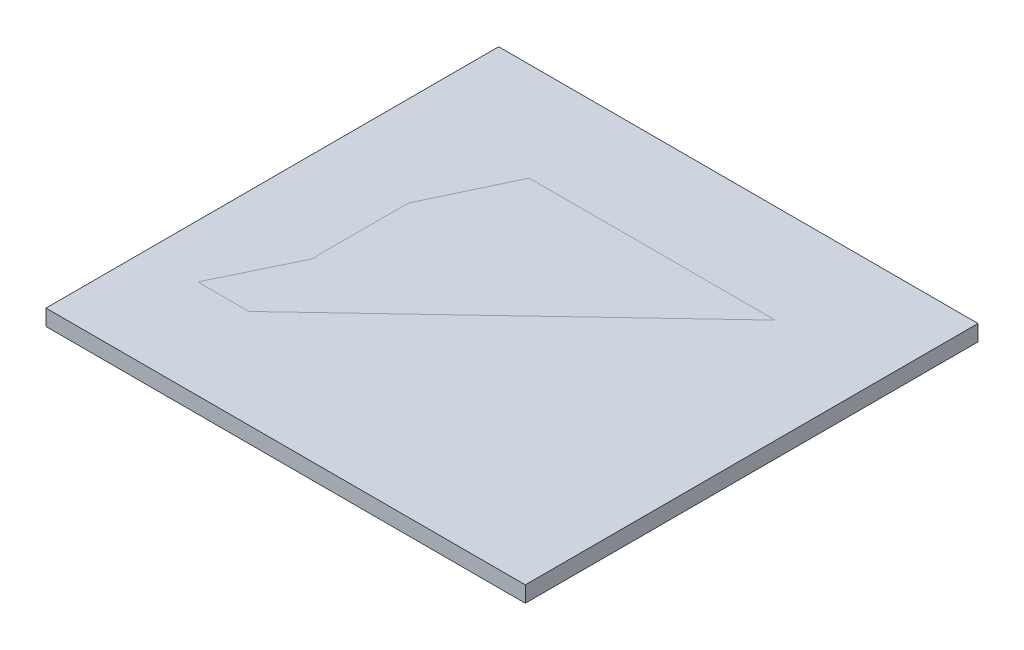
ISO-10303-21;
HEADER;
FILE_DESCRIPTION(('STEP AP214'),'2;1');
FILE_NAME('part.step','',(''),(''),'','','');
FILE_SCHEMA(('AUTOMOTIVE_DESIGN { 1 0 10303 214 1 1 1 1 }'));
ENDSEC;
DATA;
#1=APPLICATION_CONTEXT('core data for automotive mechanical design processes');
#2=APPLICATION_PROTOCOL_DEFINITION('international standard','automotive_design',2000,#1);
#3=PRODUCT_CONTEXT('',#1,'mechanical');
#4=PRODUCT('Part','Part','',(#3));
#5=PRODUCT_RELATED_PRODUCT_CATEGORY('part','',(#4));
#6=PRODUCT_DEFINITION_FORMATION('','',#4);
#7=PRODUCT_DEFINITION_CONTEXT('part definition',#1,'design');
#8=PRODUCT_DEFINITION('design','',#6,#7);
#9=PRODUCT_DEFINITION_SHAPE('','',#8);
#10=(LENGTH_UNIT() NAMED_UNIT(*) SI_UNIT(.MILLI.,.METRE.));
#11=(NAMED_UNIT(*) PLANE_ANGLE_UNIT() SI_UNIT($,.RADIAN.));
#12=(NAMED_UNIT(*) SI_UNIT($,.STERADIAN.) SOLID_ANGLE_UNIT());
#13=UNCERTAINTY_MEASURE_WITH_UNIT(LENGTH_MEASURE(1.E-05),#10,'distance_accuracy_value','');
#14=(GEOMETRIC_REPRESENTATION_CONTEXT(3) GLOBAL_UNCERTAINTY_ASSIGNED_CONTEXT((#13)) GLOBAL_UNIT_ASSIGNED_CONTEXT((#10,
#11,#12)) REPRESENTATION_CONTEXT('',''));
#15=CARTESIAN_POINT('',(0.,0.,0.));
#16=DIRECTION('',(0.,0.,1.));
#17=DIRECTION('',(1.,0.,0.));
#18=AXIS2_PLACEMENT_3D('',#15,#16,#17);
#19=CARTESIAN_POINT('',(-19.0585691573927,3.,0.));
#20=DIRECTION('',(-1.,0.,0.));
#21=DIRECTION('',(0.,0.,1.));
#22=AXIS2_PLACEMENT_3D('',#19,#20,#21);
#23=PLANE('',#22);
#24=DIRECTION('',(0.,0.,-1.));
#25=VECTOR('',#24,1.);
#26=CARTESIAN_POINT('',(-19.0585691573927,3.,0.));
#27=LINE('',#26,#25);
#28=CARTESIAN_POINT('',(-19.0585691573927,3.,-3.12464517993928));
#29=VERTEX_POINT('',#28);
#30=CARTESIAN_POINT('',(-19.0585691573927,3.,-11.1246451799393));
#31=VERTEX_POINT('',#30);
#32=EDGE_CURVE('E154',#29,#31,#27,.T.);
#33=ORIENTED_EDGE('',*,*,#32,.T.);
#34=DIRECTION('',(0.,1.,0.));
#35=VECTOR('',#34,1.);
#36=CARTESIAN_POINT('',(-19.0585691573927,-7.,-11.1246451799393));
#37=LINE('',#36,#35);
#38=CARTESIAN_POINT('',(-19.0585691573927,0.,-11.1246451799393));
#39=VERTEX_POINT('',#38);
#40=EDGE_CURVE('E148',#39,#31,#37,.T.);
#41=ORIENTED_EDGE('',*,*,#40,.F.);
#42=DIRECTION('',(0.,0.,-1.));
#43=VECTOR('',#42,1.);
#44=CARTESIAN_POINT('',(-19.0585691573927,0.,0.));
#45=LINE('',#44,#43);
#46=CARTESIAN_POINT('',(-19.0585691573927,0.,-3.12464517993928));
#47=VERTEX_POINT('',#46);
#48=EDGE_CURVE('E220',#47,#39,#45,.T.);
#49=ORIENTED_EDGE('',*,*,#48,.F.);
#50=DIRECTION('',(0.,-1.,0.));
#51=VECTOR('',#50,1.);
#52=CARTESIAN_POINT('',(-19.0585691573927,3.,-3.12464517993928));
#53=LINE('',#52,#51);
#54=EDGE_CURVE('E74',#29,#47,#53,.T.);
#55=ORIENTED_EDGE('',*,*,#54,.F.);
#56=EDGE_LOOP('',(#33,#41,#49,#55));
#57=FACE_BOUND('',#56,.T.);
#58=ADVANCED_FACE('F51',(#57),#23,.T.);
#59=CARTESIAN_POINT('',(0.,3.,0.));
#60=DIRECTION('',(0.,1.,0.));
#61=DIRECTION('',(0.,0.,1.));
#62=AXIS2_PLACEMENT_3D('',#59,#60,#61);
#63=PLANE('',#62);
#64=CARTESIAN_POINT('',(50.9414308426073,3.,2.82535482006072));
#65=DIRECTION('',(0.,1.,0.));
#66=DIRECTION('',(0.,0.,1.));
#67=AXIS2_PLACEMENT_3D('',#64,#65,#66);
#68=CIRCLE('',#67,2.);
#69=CARTESIAN_POINT('',(50.9414308426073,3.,4.82535482006073));
#70=VERTEX_POINT('',#69);
#71=EDGE_CURVE('E231',#70,#70,#68,.T.);
#72=ORIENTED_EDGE('',*,*,#71,.F.);
#73=EDGE_LOOP('',(#72));
#74=FACE_BOUND('',#73,.T.);
#75=CARTESIAN_POINT('',(50.9414308426073,3.,19.9253548200607));
#76=DIRECTION('',(0.,1.,0.));
#77=DIRECTION('',(0.,0.,1.));
#78=AXIS2_PLACEMENT_3D('',#75,#76,#77);
#79=CIRCLE('',#78,2.);
#80=CARTESIAN_POINT('',(50.9414308426073,3.,21.9253548200607));
#81=VERTEX_POINT('',#80);
#82=EDGE_CURVE('E228',#81,#81,#79,.T.);
#83=ORIENTED_EDGE('',*,*,#82,.F.);
#84=EDGE_LOOP('',(#83));
#85=FACE_BOUND('',#84,.T.);
#86=CARTESIAN_POINT('',(-14.0585691573927,3.,21.9253548200607));
#87=DIRECTION('',(0.,1.,0.));
#88=DIRECTION('',(0.,0.,1.));
#89=AXIS2_PLACEMENT_3D('',#86,#87,#88);
#90=CIRCLE('',#89,2.);
#91=CARTESIAN_POINT('',(-14.0585691573927,3.,23.9253548200607));
#92=VERTEX_POINT('',#91);
#93=EDGE_CURVE('E225',#92,#92,#90,.T.);
#94=ORIENTED_EDGE('',*,*,#93,.F.);
#95=EDGE_LOOP('',(#94));
#96=FACE_BOUND('',#95,.T.);
#97=CARTESIAN_POINT('',(-14.0585691573927,3.,3.82535482006073));
#98=DIRECTION('',(0.,1.,0.));
#99=DIRECTION('',(0.,0.,1.));
#100=AXIS2_PLACEMENT_3D('',#97,#98,#99);
#101=CIRCLE('',#100,2.);
#102=CARTESIAN_POINT('',(-14.0585691573927,3.,5.82535482006073));
#103=VERTEX_POINT('',#102);
#104=EDGE_CURVE('E222',#103,#103,#101,.T.);
#105=ORIENTED_EDGE('',*,*,#104,.F.);
#106=EDGE_LOOP('',(#105));
#107=FACE_BOUND('',#106,.T.);
#108=CARTESIAN_POINT('',(-19.0585691573927,3.,28.8753548200607));
#109=CARTESIAN_POINT('',(-19.0585691573927,3.,18.208688153394));
#110=CARTESIAN_POINT('',(-19.0585691573927,3.,7.54202148672738));
#111=CARTESIAN_POINT('',(-19.0585691573927,3.,-3.12464517993928));
#112=CARTESIAN_POINT('',(-19.0585691573927,3.,-4.54756167714658));
#113=CARTESIAN_POINT('',(-19.0585691573927,3.,-7.39339467156118));
#114=CARTESIAN_POINT('',(-13.3273186490146,3.,-11.1246451799393));
#115=CARTESIAN_POINT('',(-10.4814856546,3.,-11.1246451799393));
#116=CARTESIAN_POINT('',(-9.05856915739271,3.,-11.1246451799393));
#117=CARTESIAN_POINT('',(9.27476417594063,3.,-11.1246451799393));
#118=CARTESIAN_POINT('',(27.608097509274,3.,-11.1246451799393));
#119=CARTESIAN_POINT('',(45.9414308426073,3.,-11.1246451799393));
#120=B_SPLINE_CURVE_WITH_KNOTS('',3,(#108,#109,#110,#111,#112,#113,#114,#115,#116,#117,#118,
#119),.UNSPECIFIED.,.F.,.F.,(4,3,1,1,3,4),(0.,0.320621208481337,0.363391571628459,
0.406161934775581,0.448932297922703,1.),.UNSPECIFIED.);
#121=CARTESIAN_POINT('',(-4.83882903794871,3.,-11.1246451799393));
#122=VERTEX_POINT('',#121);
#123=CARTESIAN_POINT('',(45.9414308426073,3.,-11.1246451799393));
#124=VERTEX_POINT('',#123);
#125=EDGE_CURVE('E136',#122,#124,#120,.T.);
#126=ORIENTED_EDGE('',*,*,#125,.F.);
#127=DIRECTION('',(-1.,0.,0.));
#128=VECTOR('',#127,1.);
#129=CARTESIAN_POINT('',(-19.0585691573927,3.,-11.1246451799393));
#130=LINE('',#129,#128);
#131=EDGE_CURVE('E189',#122,#31,#130,.T.);
#132=ORIENTED_EDGE('',*,*,#131,.T.);
#133=ORIENTED_EDGE('',*,*,#32,.F.);
#134=CARTESIAN_POINT('',(-19.0585691573927,3.,28.8753548200607));
#135=VERTEX_POINT('',#134);
#136=EDGE_CURVE('E143',#135,#29,#120,.T.);
#137=ORIENTED_EDGE('',*,*,#136,.F.);
#138=DIRECTION('',(0.,0.,1.));
#139=VECTOR('',#138,1.);
#140=CARTESIAN_POINT('',(-19.0585691573927,3.,-11.1246451799393));
#141=LINE('',#140,#139);
#142=CARTESIAN_POINT('',(-19.0585691573927,3.,36.8753548200607));
#143=VERTEX_POINT('',#142);
#144=EDGE_CURVE('E95',#135,#143,#141,.T.);
#145=ORIENTED_EDGE('',*,*,#144,.T.);
#146=DIRECTION('',(1.,0.,0.));
#147=VECTOR('',#146,1.);
#148=CARTESIAN_POINT('',(0.,3.,36.8753548200607));
#149=LINE('',#148,#147);
#150=CARTESIAN_POINT('',(55.9414308426073,3.,36.8753548200607));
#151=VERTEX_POINT('',#150);
#152=EDGE_CURVE('E137',#143,#151,#149,.T.);
#153=ORIENTED_EDGE('',*,*,#152,.T.);
#154=DIRECTION('',(0.,0.,1.));
#155=VECTOR('',#154,1.);
#156=CARTESIAN_POINT('',(55.9414308426073,3.,0.));
#157=LINE('',#156,#155);
#158=CARTESIAN_POINT('',(55.9414308426073,3.,-11.1246451799393));
#159=VERTEX_POINT('',#158);
#160=EDGE_CURVE('E126',#159,#151,#157,.T.);
#161=ORIENTED_EDGE('',*,*,#160,.F.);
#162=EDGE_CURVE('E150',#159,#124,#130,.T.);
#163=ORIENTED_EDGE('',*,*,#162,.T.);
#164=EDGE_LOOP('',(#126,#132,#133,#137,#145,#153,#161,#163));
#165=FACE_BOUND('',#164,.T.);
#166=ADVANCED_FACE('F140',(#74,#85,#96,#107,#165),#63,.T.);
#167=CARTESIAN_POINT('',(0.,0.,0.));
#168=DIRECTION('',(0.,1.,0.));
#169=DIRECTION('',(0.,0.,1.));
#170=AXIS2_PLACEMENT_3D('',#167,#168,#169);
#171=PLANE('',#170);
#172=CARTESIAN_POINT('',(50.9414308426073,0.,2.82535482006072));
#173=DIRECTION('',(0.,1.,0.));
#174=DIRECTION('',(0.,0.,1.));
#175=AXIS2_PLACEMENT_3D('',#172,#173,#174);
#176=CIRCLE('',#175,2.);
#177=CARTESIAN_POINT('',(50.9414308426073,0.,4.82535482006073));
#178=VERTEX_POINT('',#177);
#179=EDGE_CURVE('E209',#178,#178,#176,.T.);
#180=ORIENTED_EDGE('',*,*,#179,.T.);
#181=EDGE_LOOP('',(#180));
#182=FACE_BOUND('',#181,.T.);
#183=CARTESIAN_POINT('',(50.9414308426073,0.,19.9253548200607));
#184=DIRECTION('',(0.,1.,0.));
#185=DIRECTION('',(0.,0.,1.));
#186=AXIS2_PLACEMENT_3D('',#183,#184,#185);
#187=CIRCLE('',#186,2.);
#188=CARTESIAN_POINT('',(50.9414308426073,0.,21.9253548200607));
#189=VERTEX_POINT('',#188);
#190=EDGE_CURVE('E213',#189,#189,#187,.T.);
#191=ORIENTED_EDGE('',*,*,#190,.T.);
#192=EDGE_LOOP('',(#191));
#193=FACE_BOUND('',#192,.T.);
#194=CARTESIAN_POINT('',(-14.0585691573927,0.,21.9253548200607));
#195=DIRECTION('',(0.,1.,0.));
#196=DIRECTION('',(0.,0.,1.));
#197=AXIS2_PLACEMENT_3D('',#194,#195,#196);
#198=CIRCLE('',#197,2.);
#199=CARTESIAN_POINT('',(-14.0585691573927,0.,23.9253548200607));
#200=VERTEX_POINT('',#199);
#201=EDGE_CURVE('E250',#200,#200,#198,.T.);
#202=ORIENTED_EDGE('',*,*,#201,.T.);
#203=EDGE_LOOP('',(#202));
#204=FACE_BOUND('',#203,.T.);
#205=CARTESIAN_POINT('',(-14.0585691573927,0.,3.82535482006073));
#206=DIRECTION('',(0.,1.,0.));
#207=DIRECTION('',(0.,0.,1.));
#208=AXIS2_PLACEMENT_3D('',#205,#206,#207);
#209=CIRCLE('',#208,2.);
#210=CARTESIAN_POINT('',(-14.0585691573927,0.,5.82535482006073));
#211=VERTEX_POINT('',#210);
#212=EDGE_CURVE('E156',#211,#211,#209,.T.);
#213=ORIENTED_EDGE('',*,*,#212,.T.);
#214=EDGE_LOOP('',(#213));
#215=FACE_BOUND('',#214,.T.);
#216=DIRECTION('',(-1.,0.,0.));
#217=VECTOR('',#216,1.);
#218=CARTESIAN_POINT('',(0.,0.,-11.1246451799393));
#219=LINE('',#218,#217);
#220=CARTESIAN_POINT('',(-4.83882903794871,0.,-11.1246451799393));
#221=VERTEX_POINT('',#220);
#222=EDGE_CURVE('E12',#221,#39,#219,.T.);
#223=ORIENTED_EDGE('',*,*,#222,.F.);
#224=CARTESIAN_POINT('',(-19.0585691573927,0.,28.8753548200607));
#225=CARTESIAN_POINT('',(-19.0585691573927,0.,18.208688153394));
#226=CARTESIAN_POINT('',(-19.0585691573927,0.,7.54202148672738));
#227=CARTESIAN_POINT('',(-19.0585691573927,0.,-3.12464517993928));
#228=CARTESIAN_POINT('',(-19.0585691573927,0.,-4.54756167714658));
#229=CARTESIAN_POINT('',(-19.0585691573927,0.,-7.39339467156118));
#230=CARTESIAN_POINT('',(-13.3273186490146,0.,-11.1246451799393));
#231=CARTESIAN_POINT('',(-10.4814856546,0.,-11.1246451799393));
#232=CARTESIAN_POINT('',(-9.05856915739271,0.,-11.1246451799393));
#233=CARTESIAN_POINT('',(9.27476417594063,0.,-11.1246451799393));
#234=CARTESIAN_POINT('',(27.608097509274,0.,-11.1246451799393));
#235=CARTESIAN_POINT('',(45.9414308426073,0.,-11.1246451799393));
#236=B_SPLINE_CURVE_WITH_KNOTS('',3,(#224,#225,#226,#227,#228,#229,#230,#231,#232,#233,#234,
#235),.UNSPECIFIED.,.F.,.F.,(4,3,1,1,3,4),(0.,0.320621208481337,0.363391571628459,
0.406161934775581,0.448932297922703,1.),.UNSPECIFIED.);
#237=CARTESIAN_POINT('',(45.9414308426073,0.,-11.1246451799393));
#238=VERTEX_POINT('',#237);
#239=EDGE_CURVE('E207',#221,#238,#236,.T.);
#240=ORIENTED_EDGE('',*,*,#239,.T.);
#241=CARTESIAN_POINT('',(55.9414308426073,0.,-11.1246451799393));
#242=VERTEX_POINT('',#241);
#243=EDGE_CURVE('E54',#242,#238,#219,.T.);
#244=ORIENTED_EDGE('',*,*,#243,.F.);
#245=DIRECTION('',(0.,0.,1.));
#246=VECTOR('',#245,1.);
#247=CARTESIAN_POINT('',(55.9414308426073,0.,0.));
#248=LINE('',#247,#246);
#249=CARTESIAN_POINT('',(55.9414308426073,0.,36.8753548200607));
#250=VERTEX_POINT('',#249);
#251=EDGE_CURVE('E210',#242,#250,#248,.T.);
#252=ORIENTED_EDGE('',*,*,#251,.T.);
#253=DIRECTION('',(1.,0.,0.));
#254=VECTOR('',#253,1.);
#255=CARTESIAN_POINT('',(0.,0.,36.8753548200607));
#256=LINE('',#255,#254);
#257=CARTESIAN_POINT('',(-19.0585691573927,0.,36.8753548200607));
#258=VERTEX_POINT('',#257);
#259=EDGE_CURVE('E65',#258,#250,#256,.T.);
#260=ORIENTED_EDGE('',*,*,#259,.F.);
#261=DIRECTION('',(0.,0.,1.));
#262=VECTOR('',#261,1.);
#263=CARTESIAN_POINT('',(-19.0585691573927,0.,0.));
#264=LINE('',#263,#262);
#265=CARTESIAN_POINT('',(-19.0585691573927,0.,28.8753548200607));
#266=VERTEX_POINT('',#265);
#267=EDGE_CURVE('E194',#266,#258,#264,.T.);
#268=ORIENTED_EDGE('',*,*,#267,.F.);
#269=EDGE_CURVE('E191',#266,#47,#236,.T.);
#270=ORIENTED_EDGE('',*,*,#269,.T.);
#271=ORIENTED_EDGE('',*,*,#48,.T.);
#272=EDGE_LOOP('',(#223,#240,#244,#252,#260,#268,#270,#271));
#273=FACE_BOUND('',#272,.T.);
#274=ADVANCED_FACE('F179',(#182,#193,#204,#215,#273),#171,.F.);
#275=DIRECTION('',(0.,-1.,0.));
#276=VECTOR('',#275,1.);
#277=SURFACE_OF_LINEAR_EXTRUSION('',#120,#276);
#278=ORIENTED_EDGE('',*,*,#269,.F.);
#279=DIRECTION('',(0.,-1.,0.));
#280=VECTOR('',#279,1.);
#281=CARTESIAN_POINT('',(-19.0585691573927,3.,28.8753548200607));
#282=LINE('',#281,#280);
#283=EDGE_CURVE('E91',#135,#266,#282,.T.);
#284=ORIENTED_EDGE('',*,*,#283,.F.);
#285=ORIENTED_EDGE('',*,*,#136,.T.);
#286=ORIENTED_EDGE('',*,*,#54,.T.);
#287=EDGE_LOOP('',(#278,#284,#285,#286));
#288=FACE_BOUND('',#287,.T.);
#289=ADVANCED_FACE('F171',(#288),#277,.T.);
#290=CARTESIAN_POINT('',(0.,3.,36.8753548200607));
#291=DIRECTION('',(0.,0.,-1.));
#292=DIRECTION('',(-1.,0.,0.));
#293=AXIS2_PLACEMENT_3D('',#290,#291,#292);
#294=PLANE('',#293);
#295=ORIENTED_EDGE('',*,*,#259,.T.);
#296=DIRECTION('',(0.,1.,0.));
#297=VECTOR('',#296,1.);
#298=CARTESIAN_POINT('',(55.9414308426073,-7.,36.8753548200607));
#299=LINE('',#298,#297);
#300=EDGE_CURVE('E130',#250,#151,#299,.T.);
#301=ORIENTED_EDGE('',*,*,#300,.T.);
#302=ORIENTED_EDGE('',*,*,#152,.F.);
#303=DIRECTION('',(0.,1.,0.));
#304=VECTOR('',#303,1.);
#305=CARTESIAN_POINT('',(-19.0585691573927,-7.,36.8753548200607));
#306=LINE('',#305,#304);
#307=EDGE_CURVE('E146',#258,#143,#306,.T.);
#308=ORIENTED_EDGE('',*,*,#307,.F.);
#309=EDGE_LOOP('',(#295,#301,#302,#308));
#310=FACE_BOUND('',#309,.T.);
#311=ADVANCED_FACE('F145',(#310),#294,.F.);
#312=CARTESIAN_POINT('',(55.9414308426073,3.,0.));
#313=DIRECTION('',(1.,0.,0.));
#314=DIRECTION('',(0.,0.,-1.));
#315=AXIS2_PLACEMENT_3D('',#312,#313,#314);
#316=PLANE('',#315);
#317=ORIENTED_EDGE('',*,*,#251,.F.);
#318=DIRECTION('',(0.,1.,0.));
#319=VECTOR('',#318,1.);
#320=CARTESIAN_POINT('',(55.9414308426073,-7.,-11.1246451799393));
#321=LINE('',#320,#319);
#322=EDGE_CURVE('E132',#242,#159,#321,.T.);
#323=ORIENTED_EDGE('',*,*,#322,.T.);
#324=ORIENTED_EDGE('',*,*,#160,.T.);
#325=ORIENTED_EDGE('',*,*,#300,.F.);
#326=EDGE_LOOP('',(#317,#323,#324,#325));
#327=FACE_BOUND('',#326,.T.);
#328=ADVANCED_FACE('F128',(#327),#316,.T.);
#329=CARTESIAN_POINT('',(-14.0585691573927,3.,3.82535482006073));
#330=DIRECTION('',(0.,-1.,0.));
#331=DIRECTION('',(0.,0.,-1.));
#332=AXIS2_PLACEMENT_3D('',#329,#330,#331);
#333=CYLINDRICAL_SURFACE('',#332,2.);
#334=ORIENTED_EDGE('',*,*,#104,.T.);
#335=EDGE_LOOP('',(#334));
#336=FACE_BOUND('',#335,.T.);
#337=ORIENTED_EDGE('',*,*,#212,.F.);
#338=EDGE_LOOP('',(#337));
#339=FACE_BOUND('',#338,.T.);
#340=ADVANCED_FACE('F174',(#336,#339),#333,.F.);
#341=CARTESIAN_POINT('',(-14.0585691573927,3.,21.9253548200607));
#342=DIRECTION('',(0.,-1.,0.));
#343=DIRECTION('',(0.,0.,-1.));
#344=AXIS2_PLACEMENT_3D('',#341,#342,#343);
#345=CYLINDRICAL_SURFACE('',#344,2.);
#346=ORIENTED_EDGE('',*,*,#93,.T.);
#347=EDGE_LOOP('',(#346));
#348=FACE_BOUND('',#347,.T.);
#349=ORIENTED_EDGE('',*,*,#201,.F.);
#350=EDGE_LOOP('',(#349));
#351=FACE_BOUND('',#350,.T.);
#352=ADVANCED_FACE('F245',(#348,#351),#345,.F.);
#353=CARTESIAN_POINT('',(50.9414308426073,3.,19.9253548200607));
#354=DIRECTION('',(0.,-1.,0.));
#355=DIRECTION('',(0.,0.,-1.));
#356=AXIS2_PLACEMENT_3D('',#353,#354,#355);
#357=CYLINDRICAL_SURFACE('',#356,2.);
#358=ORIENTED_EDGE('',*,*,#82,.T.);
#359=EDGE_LOOP('',(#358));
#360=FACE_BOUND('',#359,.T.);
#361=ORIENTED_EDGE('',*,*,#190,.F.);
#362=EDGE_LOOP('',(#361));
#363=FACE_BOUND('',#362,.T.);
#364=ADVANCED_FACE('F271',(#360,#363),#357,.F.);
#365=CARTESIAN_POINT('',(50.9414308426073,3.,2.82535482006072));
#366=DIRECTION('',(0.,-1.,0.));
#367=DIRECTION('',(0.,0.,-1.));
#368=AXIS2_PLACEMENT_3D('',#365,#366,#367);
#369=CYLINDRICAL_SURFACE('',#368,2.);
#370=ORIENTED_EDGE('',*,*,#71,.T.);
#371=EDGE_LOOP('',(#370));
#372=FACE_BOUND('',#371,.T.);
#373=ORIENTED_EDGE('',*,*,#179,.F.);
#374=EDGE_LOOP('',(#373));
#375=FACE_BOUND('',#374,.T.);
#376=ADVANCED_FACE('F169',(#372,#375),#369,.F.);
#377=ORIENTED_EDGE('',*,*,#239,.F.);
#378=DIRECTION('',(0.,-1.,0.));
#379=VECTOR('',#378,1.);
#380=CARTESIAN_POINT('',(-4.83882903794871,3.,-11.1246451799393));
#381=LINE('',#380,#379);
#382=EDGE_CURVE('E197',#122,#221,#381,.T.);
#383=ORIENTED_EDGE('',*,*,#382,.F.);
#384=ORIENTED_EDGE('',*,*,#125,.T.);
#385=DIRECTION('',(0.,-1.,0.));
#386=VECTOR('',#385,1.);
#387=CARTESIAN_POINT('',(45.9414308426073,3.,-11.1246451799393));
#388=LINE('',#387,#386);
#389=EDGE_CURVE('E192',#124,#238,#388,.T.);
#390=ORIENTED_EDGE('',*,*,#389,.T.);
#391=EDGE_LOOP('',(#377,#383,#384,#390));
#392=FACE_BOUND('',#391,.T.);
#393=ADVANCED_FACE('F164',(#392),#277,.T.);
#394=CARTESIAN_POINT('',(-19.0585691573927,-7.,-11.1246451799393));
#395=DIRECTION('',(-1.,0.,0.));
#396=DIRECTION('',(0.,0.,1.));
#397=AXIS2_PLACEMENT_3D('',#394,#395,#396);
#398=PLANE('',#397);
#399=ORIENTED_EDGE('',*,*,#283,.T.);
#400=ORIENTED_EDGE('',*,*,#267,.T.);
#401=ORIENTED_EDGE('',*,*,#307,.T.);
#402=ORIENTED_EDGE('',*,*,#144,.F.);
#403=EDGE_LOOP('',(#399,#400,#401,#402));
#404=FACE_BOUND('',#403,.T.);
#405=ADVANCED_FACE('F168',(#404),#398,.T.);
#406=CARTESIAN_POINT('',(-19.0585691573927,-7.,-11.1246451799393));
#407=DIRECTION('',(0.,0.,-1.));
#408=DIRECTION('',(-1.,0.,0.));
#409=AXIS2_PLACEMENT_3D('',#406,#407,#408);
#410=PLANE('',#409);
#411=ORIENTED_EDGE('',*,*,#162,.F.);
#412=ORIENTED_EDGE('',*,*,#322,.F.);
#413=ORIENTED_EDGE('',*,*,#243,.T.);
#414=ORIENTED_EDGE('',*,*,#389,.F.);
#415=EDGE_LOOP('',(#411,#412,#413,#414));
#416=FACE_BOUND('',#415,.T.);
#417=ADVANCED_FACE('F202',(#416),#410,.T.);
#418=ORIENTED_EDGE('',*,*,#382,.T.);
#419=ORIENTED_EDGE('',*,*,#222,.T.);
#420=ORIENTED_EDGE('',*,*,#40,.T.);
#421=ORIENTED_EDGE('',*,*,#131,.F.);
#422=EDGE_LOOP('',(#418,#419,#420,#421));
#423=FACE_BOUND('',#422,.T.);
#424=ADVANCED_FACE('F256',(#423),#410,.T.);
#425=CLOSED_SHELL('',(#58,#166,#274,#289,#311,#328,#340,#352,#364,#376,#393,#405,#417,#424));
#426=MANIFOLD_SOLID_BREP('B2',#425);
#427=CARTESIAN_POINT('',(-29.0585691573927,3.,55.3753548200607));
#428=DIRECTION('',(1.,0.,0.));
#429=DIRECTION('',(0.,0.,-1.));
#430=AXIS2_PLACEMENT_3D('',#427,#428,#429);
#431=PLANE('',#430);
#432=DIRECTION('',(0.,0.,1.));
#433=VECTOR('',#432,1.);
#434=CARTESIAN_POINT('',(-29.0585691573927,0.,55.3753548200607));
#435=LINE('',#434,#433);
#436=CARTESIAN_POINT('',(-29.0585691573927,0.,-29.6246451799393));
#437=VERTEX_POINT('',#436);
#438=CARTESIAN_POINT('',(-29.0585691573927,0.,55.3753548200607));
#439=VERTEX_POINT('',#438);
#440=EDGE_CURVE('E485',#437,#439,#435,.T.);
#441=ORIENTED_EDGE('',*,*,#440,.T.);
#442=DIRECTION('',(0.,-1.,0.));
#443=VECTOR('',#442,1.);
#444=CARTESIAN_POINT('',(-29.0585691573927,3.,55.3753548200607));
#445=LINE('',#444,#443);
#446=CARTESIAN_POINT('',(-29.0585691573927,3.,55.3753548200607));
#447=VERTEX_POINT('',#446);
#448=EDGE_CURVE('E49',#447,#439,#445,.T.);
#449=ORIENTED_EDGE('',*,*,#448,.F.);
#450=DIRECTION('',(0.,0.,1.));
#451=VECTOR('',#450,1.);
#452=CARTESIAN_POINT('',(-29.0585691573927,3.,55.3753548200607));
#453=LINE('',#452,#451);
#454=CARTESIAN_POINT('',(-29.0585691573927,3.,-29.6246451799393));
#455=VERTEX_POINT('',#454);
#456=EDGE_CURVE('E473',#455,#447,#453,.T.);
#457=ORIENTED_EDGE('',*,*,#456,.F.);
#458=DIRECTION('',(0.,-1.,0.));
#459=VECTOR('',#458,1.);
#460=CARTESIAN_POINT('',(-29.0585691573927,3.,-29.6246451799393));
#461=LINE('',#460,#459);
#462=EDGE_CURVE('E481',#455,#437,#461,.T.);
#463=ORIENTED_EDGE('',*,*,#462,.T.);
#464=EDGE_LOOP('',(#441,#449,#457,#463));
#465=FACE_BOUND('',#464,.T.);
#466=ADVANCED_FACE('F422',(#465),#431,.F.);
#467=CARTESIAN_POINT('',(-29.0585691573927,3.,55.3753548200607));
#468=DIRECTION('',(0.,0.,-1.));
#469=DIRECTION('',(-1.,0.,0.));
#470=AXIS2_PLACEMENT_3D('',#467,#468,#469);
#471=PLANE('',#470);
#472=DIRECTION('',(1.,0.,0.));
#473=VECTOR('',#472,1.);
#474=CARTESIAN_POINT('',(-29.0585691573927,0.,55.3753548200607));
#475=LINE('',#474,#473);
#476=CARTESIAN_POINT('',(60.9414308426073,0.,55.3753548200607));
#477=VERTEX_POINT('',#476);
#478=EDGE_CURVE('E477',#439,#477,#475,.T.);
#479=ORIENTED_EDGE('',*,*,#478,.T.);
#480=DIRECTION('',(0.,-1.,0.));
#481=VECTOR('',#480,1.);
#482=CARTESIAN_POINT('',(60.9414308426073,3.,55.3753548200607));
#483=LINE('',#482,#481);
#484=CARTESIAN_POINT('',(60.9414308426073,3.,55.3753548200607));
#485=VERTEX_POINT('',#484);
#486=EDGE_CURVE('E430',#485,#477,#483,.T.);
#487=ORIENTED_EDGE('',*,*,#486,.F.);
#488=DIRECTION('',(1.,0.,0.));
#489=VECTOR('',#488,1.);
#490=CARTESIAN_POINT('',(-29.0585691573927,3.,55.3753548200607));
#491=LINE('',#490,#489);
#492=EDGE_CURVE('E468',#447,#485,#491,.T.);
#493=ORIENTED_EDGE('',*,*,#492,.F.);
#494=ORIENTED_EDGE('',*,*,#448,.T.);
#495=EDGE_LOOP('',(#479,#487,#493,#494));
#496=FACE_BOUND('',#495,.T.);
#497=ADVANCED_FACE('F476',(#496),#471,.F.);
#498=CARTESIAN_POINT('',(60.9414308426073,3.,55.3753548200607));
#499=DIRECTION('',(-1.,0.,0.));
#500=DIRECTION('',(0.,0.,1.));
#501=AXIS2_PLACEMENT_3D('',#498,#499,#500);
#502=PLANE('',#501);
#503=DIRECTION('',(0.,0.,-1.));
#504=VECTOR('',#503,1.);
#505=CARTESIAN_POINT('',(60.9414308426073,0.,55.3753548200607));
#506=LINE('',#505,#504);
#507=CARTESIAN_POINT('',(60.9414308426073,0.,-29.6246451799393));
#508=VERTEX_POINT('',#507);
#509=EDGE_CURVE('E455',#477,#508,#506,.T.);
#510=ORIENTED_EDGE('',*,*,#509,.T.);
#511=DIRECTION('',(0.,-1.,0.));
#512=VECTOR('',#511,1.);
#513=CARTESIAN_POINT('',(60.9414308426073,3.,-29.6246451799393));
#514=LINE('',#513,#512);
#515=CARTESIAN_POINT('',(60.9414308426073,3.,-29.6246451799393));
#516=VERTEX_POINT('',#515);
#517=EDGE_CURVE('E478',#516,#508,#514,.T.);
#518=ORIENTED_EDGE('',*,*,#517,.F.);
#519=DIRECTION('',(0.,0.,-1.));
#520=VECTOR('',#519,1.);
#521=CARTESIAN_POINT('',(60.9414308426073,3.,55.3753548200607));
#522=LINE('',#521,#520);
#523=EDGE_CURVE('E471',#485,#516,#522,.T.);
#524=ORIENTED_EDGE('',*,*,#523,.F.);
#525=ORIENTED_EDGE('',*,*,#486,.T.);
#526=EDGE_LOOP('',(#510,#518,#524,#525));
#527=FACE_BOUND('',#526,.T.);
#528=ADVANCED_FACE('F479',(#527),#502,.F.);
#529=CARTESIAN_POINT('',(-29.0585691573927,3.,-29.6246451799393));
#530=DIRECTION('',(0.,0.,1.));
#531=DIRECTION('',(1.,0.,0.));
#532=AXIS2_PLACEMENT_3D('',#529,#530,#531);
#533=PLANE('',#532);
#534=DIRECTION('',(-1.,0.,0.));
#535=VECTOR('',#534,1.);
#536=CARTESIAN_POINT('',(-29.0585691573927,0.,-29.6246451799393));
#537=LINE('',#536,#535);
#538=EDGE_CURVE('E461',#508,#437,#537,.T.);
#539=ORIENTED_EDGE('',*,*,#538,.T.);
#540=ORIENTED_EDGE('',*,*,#462,.F.);
#541=DIRECTION('',(-1.,0.,0.));
#542=VECTOR('',#541,1.);
#543=CARTESIAN_POINT('',(-29.0585691573927,3.,-29.6246451799393));
#544=LINE('',#543,#542);
#545=EDGE_CURVE('E438',#516,#455,#544,.T.);
#546=ORIENTED_EDGE('',*,*,#545,.F.);
#547=ORIENTED_EDGE('',*,*,#517,.T.);
#548=EDGE_LOOP('',(#539,#540,#546,#547));
#549=FACE_BOUND('',#548,.T.);
#550=ADVANCED_FACE('F492',(#549),#533,.F.);
#551=CARTESIAN_POINT('',(0.,3.,0.));
#552=DIRECTION('',(0.,-1.,0.));
#553=DIRECTION('',(0.,0.,-1.));
#554=AXIS2_PLACEMENT_3D('',#551,#552,#553);
#555=PLANE('',#554);
#556=ORIENTED_EDGE('',*,*,#456,.T.);
#557=ORIENTED_EDGE('',*,*,#492,.T.);
#558=ORIENTED_EDGE('',*,*,#523,.T.);
#559=ORIENTED_EDGE('',*,*,#545,.T.);
#560=EDGE_LOOP('',(#556,#557,#558,#559));
#561=FACE_BOUND('',#560,.T.);
#562=ADVANCED_FACE('F469',(#561),#555,.F.);
#563=CARTESIAN_POINT('',(0.,0.,0.));
#564=DIRECTION('',(0.,-1.,0.));
#565=DIRECTION('',(0.,0.,-1.));
#566=AXIS2_PLACEMENT_3D('',#563,#564,#565);
#567=PLANE('',#566);
#568=ORIENTED_EDGE('',*,*,#440,.F.);
#569=ORIENTED_EDGE('',*,*,#538,.F.);
#570=ORIENTED_EDGE('',*,*,#509,.F.);
#571=ORIENTED_EDGE('',*,*,#478,.F.);
#572=EDGE_LOOP('',(#568,#569,#570,#571));
#573=FACE_BOUND('',#572,.T.);
#574=ADVANCED_FACE('F495',(#573),#567,.T.);
#575=CLOSED_SHELL('',(#466,#497,#528,#550,#562,#574));
#576=MANIFOLD_SOLID_BREP('B6_NOT_SHOWN',#575);
#577=ADVANCED_BREP_SHAPE_REPRESENTATION('',(#18,#426,#576),#14);
#578=SHAPE_DEFINITION_REPRESENTATION(#9,#577);
ENDSEC;
END-ISO-10303-21;
